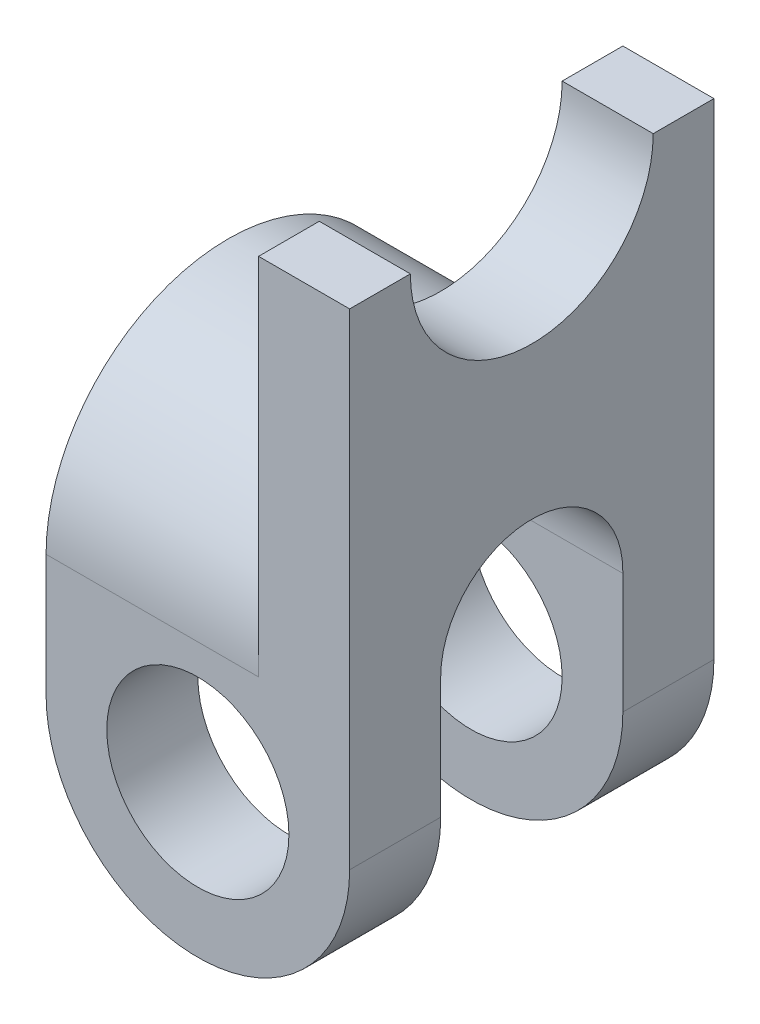
ISO-10303-21;
HEADER;
FILE_DESCRIPTION(('STEP AP214'),'2;1');
FILE_NAME('part.step','',(''),(''),'','','');
FILE_SCHEMA(('AUTOMOTIVE_DESIGN { 1 0 10303 214 1 1 1 1 }'));
ENDSEC;
DATA;
#1=APPLICATION_CONTEXT('core data for automotive mechanical design processes');
#2=APPLICATION_PROTOCOL_DEFINITION('international standard','automotive_design',2000,#1);
#3=PRODUCT_CONTEXT('',#1,'mechanical');
#4=PRODUCT('Part','Part','',(#3));
#5=PRODUCT_RELATED_PRODUCT_CATEGORY('part','',(#4));
#6=PRODUCT_DEFINITION_FORMATION('','',#4);
#7=PRODUCT_DEFINITION_CONTEXT('part definition',#1,'design');
#8=PRODUCT_DEFINITION('design','',#6,#7);
#9=PRODUCT_DEFINITION_SHAPE('','',#8);
#10=(LENGTH_UNIT() NAMED_UNIT(*) SI_UNIT(.MILLI.,.METRE.));
#11=(NAMED_UNIT(*) PLANE_ANGLE_UNIT() SI_UNIT($,.RADIAN.));
#12=(NAMED_UNIT(*) SI_UNIT($,.STERADIAN.) SOLID_ANGLE_UNIT());
#13=UNCERTAINTY_MEASURE_WITH_UNIT(LENGTH_MEASURE(1.E-05),#10,'distance_accuracy_value','');
#14=(GEOMETRIC_REPRESENTATION_CONTEXT(3) GLOBAL_UNCERTAINTY_ASSIGNED_CONTEXT((#13)) GLOBAL_UNIT_ASSIGNED_CONTEXT((#10,
#11,#12)) REPRESENTATION_CONTEXT('',''));
#15=CARTESIAN_POINT('',(0.,0.,0.));
#16=DIRECTION('',(0.,0.,1.));
#17=DIRECTION('',(1.,0.,0.));
#18=AXIS2_PLACEMENT_3D('',#15,#16,#17);
#19=CARTESIAN_POINT('',(0.,0.,30.));
#20=DIRECTION('',(0.,0.,-1.));
#21=DIRECTION('',(-1.,0.,0.));
#22=AXIS2_PLACEMENT_3D('',#19,#20,#21);
#23=CYLINDRICAL_SURFACE('',#22,25.);
#24=DIRECTION('',(0.,0.,-1.));
#25=VECTOR('',#24,1.);
#26=CARTESIAN_POINT('',(25.,0.,30.));
#27=LINE('',#26,#25);
#28=CARTESIAN_POINT('',(25.,0.,-15.));
#29=VERTEX_POINT('',#28);
#30=CARTESIAN_POINT('',(25.,0.,-30.));
#31=VERTEX_POINT('',#30);
#32=EDGE_CURVE('E262',#29,#31,#27,.T.);
#33=ORIENTED_EDGE('',*,*,#32,.F.);
#34=CARTESIAN_POINT('',(0.,0.,-15.));
#35=DIRECTION('',(0.,0.,-1.));
#36=DIRECTION('',(-1.,0.,0.));
#37=AXIS2_PLACEMENT_3D('',#34,#35,#36);
#38=CIRCLE('',#37,25.);
#39=CARTESIAN_POINT('',(-25.,0.,-15.));
#40=VERTEX_POINT('',#39);
#41=EDGE_CURVE('E174',#29,#40,#38,.T.);
#42=ORIENTED_EDGE('',*,*,#41,.T.);
#43=DIRECTION('',(0.,0.,-1.));
#44=VECTOR('',#43,1.);
#45=CARTESIAN_POINT('',(-25.,0.,30.));
#46=LINE('',#45,#44);
#47=CARTESIAN_POINT('',(-25.,0.,-30.));
#48=VERTEX_POINT('',#47);
#49=EDGE_CURVE('E225',#40,#48,#46,.T.);
#50=ORIENTED_EDGE('',*,*,#49,.T.);
#51=CARTESIAN_POINT('',(0.,0.,-30.));
#52=DIRECTION('',(0.,0.,1.));
#53=DIRECTION('',(1.,0.,0.));
#54=AXIS2_PLACEMENT_3D('',#51,#52,#53);
#55=CIRCLE('',#54,25.);
#56=EDGE_CURVE('E199',#48,#31,#55,.T.);
#57=ORIENTED_EDGE('',*,*,#56,.T.);
#58=EDGE_LOOP('',(#33,#42,#50,#57));
#59=FACE_BOUND('',#58,.T.);
#60=ADVANCED_FACE('F43',(#59),#23,.T.);
#61=CARTESIAN_POINT('',(0.,0.,30.));
#62=DIRECTION('',(0.,0.,-1.));
#63=DIRECTION('',(-1.,0.,0.));
#64=AXIS2_PLACEMENT_3D('',#61,#62,#63);
#65=CYLINDRICAL_SURFACE('',#64,15.);
#66=CARTESIAN_POINT('',(0.,0.,-15.));
#67=DIRECTION('',(0.,0.,-1.));
#68=DIRECTION('',(-1.,0.,0.));
#69=AXIS2_PLACEMENT_3D('',#66,#67,#68);
#70=CIRCLE('',#69,15.);
#71=CARTESIAN_POINT('',(-15.,0.,-15.));
#72=VERTEX_POINT('',#71);
#73=EDGE_CURVE('E47',#72,#72,#70,.T.);
#74=ORIENTED_EDGE('',*,*,#73,.F.);
#75=EDGE_LOOP('',(#74));
#76=FACE_BOUND('',#75,.T.);
#77=CARTESIAN_POINT('',(0.,0.,-30.));
#78=DIRECTION('',(0.,0.,1.));
#79=DIRECTION('',(1.,0.,0.));
#80=AXIS2_PLACEMENT_3D('',#77,#78,#79);
#81=CIRCLE('',#80,15.);
#82=CARTESIAN_POINT('',(15.,0.,-30.));
#83=VERTEX_POINT('',#82);
#84=EDGE_CURVE('E194',#83,#83,#81,.T.);
#85=ORIENTED_EDGE('',*,*,#84,.F.);
#86=EDGE_LOOP('',(#85));
#87=FACE_BOUND('',#86,.T.);
#88=ADVANCED_FACE('F275',(#76,#87),#65,.F.);
#89=CARTESIAN_POINT('',(10.,22.9128784747792,30.));
#90=DIRECTION('',(1.,0.,0.));
#91=DIRECTION('',(0.,0.,-1.));
#92=AXIS2_PLACEMENT_3D('',#89,#90,#91);
#93=PLANE('',#92);
#94=DIRECTION('',(0.,-1.,0.));
#95=VECTOR('',#94,1.);
#96=CARTESIAN_POINT('',(10.,22.9128784747792,-30.));
#97=LINE('',#96,#95);
#98=CARTESIAN_POINT('',(10.,80.,-30.));
#99=VERTEX_POINT('',#98);
#100=CARTESIAN_POINT('',(10.,20.,-30.));
#101=VERTEX_POINT('',#100);
#102=EDGE_CURVE('E237',#99,#101,#97,.T.);
#103=ORIENTED_EDGE('',*,*,#102,.T.);
#104=CARTESIAN_POINT('',(10.,20.,0.));
#105=DIRECTION('',(1.,0.,0.));
#106=DIRECTION('',(0.,0.,-1.));
#107=AXIS2_PLACEMENT_3D('',#104,#105,#106);
#108=CIRCLE('',#107,30.);
#109=CARTESIAN_POINT('',(10.,20.,30.));
#110=VERTEX_POINT('',#109);
#111=EDGE_CURVE('E181',#110,#101,#108,.F.);
#112=ORIENTED_EDGE('',*,*,#111,.F.);
#113=DIRECTION('',(0.,-1.,0.));
#114=VECTOR('',#113,1.);
#115=CARTESIAN_POINT('',(10.,80.,30.));
#116=LINE('',#115,#114);
#117=CARTESIAN_POINT('',(10.,80.,30.));
#118=VERTEX_POINT('',#117);
#119=EDGE_CURVE('E214',#118,#110,#116,.T.);
#120=ORIENTED_EDGE('',*,*,#119,.F.);
#121=DIRECTION('',(0.,0.,-1.));
#122=VECTOR('',#121,1.);
#123=CARTESIAN_POINT('',(10.,80.,30.));
#124=LINE('',#123,#122);
#125=CARTESIAN_POINT('',(10.,80.,20.));
#126=VERTEX_POINT('',#125);
#127=EDGE_CURVE('E253',#118,#126,#124,.T.);
#128=ORIENTED_EDGE('',*,*,#127,.T.);
#129=CARTESIAN_POINT('',(10.,80.,0.));
#130=DIRECTION('',(1.,0.,0.));
#131=DIRECTION('',(0.,0.,-1.));
#132=AXIS2_PLACEMENT_3D('',#129,#130,#131);
#133=CIRCLE('',#132,20.);
#134=CARTESIAN_POINT('',(10.,80.,-20.));
#135=VERTEX_POINT('',#134);
#136=EDGE_CURVE('E11',#126,#135,#133,.T.);
#137=ORIENTED_EDGE('',*,*,#136,.T.);
#138=EDGE_CURVE('E252',#135,#99,#124,.T.);
#139=ORIENTED_EDGE('',*,*,#138,.T.);
#140=EDGE_LOOP('',(#103,#112,#120,#128,#137,#139));
#141=FACE_BOUND('',#140,.T.);
#142=ADVANCED_FACE('F290',(#141),#93,.F.);
#143=CARTESIAN_POINT('',(25.,80.,30.));
#144=DIRECTION('',(0.,-1.,0.));
#145=DIRECTION('',(0.,0.,-1.));
#146=AXIS2_PLACEMENT_3D('',#143,#144,#145);
#147=PLANE('',#146);
#148=DIRECTION('',(0.,0.,-1.));
#149=VECTOR('',#148,1.);
#150=CARTESIAN_POINT('',(25.,80.,30.));
#151=LINE('',#150,#149);
#152=CARTESIAN_POINT('',(25.,80.,30.));
#153=VERTEX_POINT('',#152);
#154=CARTESIAN_POINT('',(25.,80.,20.));
#155=VERTEX_POINT('',#154);
#156=EDGE_CURVE('E258',#153,#155,#151,.T.);
#157=ORIENTED_EDGE('',*,*,#156,.T.);
#158=DIRECTION('',(-1.,0.,0.));
#159=VECTOR('',#158,1.);
#160=CARTESIAN_POINT('',(25.,80.,20.));
#161=LINE('',#160,#159);
#162=EDGE_CURVE('E190',#155,#126,#161,.T.);
#163=ORIENTED_EDGE('',*,*,#162,.T.);
#164=ORIENTED_EDGE('',*,*,#127,.F.);
#165=DIRECTION('',(-1.,0.,0.));
#166=VECTOR('',#165,1.);
#167=CARTESIAN_POINT('',(25.,80.,30.));
#168=LINE('',#167,#166);
#169=EDGE_CURVE('E211',#153,#118,#168,.T.);
#170=ORIENTED_EDGE('',*,*,#169,.F.);
#171=EDGE_LOOP('',(#157,#163,#164,#170));
#172=FACE_BOUND('',#171,.T.);
#173=ADVANCED_FACE('F281',(#172),#147,.F.);
#174=CARTESIAN_POINT('',(0.,0.,30.));
#175=DIRECTION('',(0.,0.,1.));
#176=DIRECTION('',(1.,0.,0.));
#177=AXIS2_PLACEMENT_3D('',#174,#175,#176);
#178=PLANE('',#177);
#179=CARTESIAN_POINT('',(0.,0.,30.));
#180=DIRECTION('',(0.,0.,1.));
#181=DIRECTION('',(1.,0.,0.));
#182=AXIS2_PLACEMENT_3D('',#179,#180,#181);
#183=CIRCLE('',#182,25.);
#184=CARTESIAN_POINT('',(-25.,0.,30.));
#185=VERTEX_POINT('',#184);
#186=CARTESIAN_POINT('',(25.,0.,30.));
#187=VERTEX_POINT('',#186);
#188=EDGE_CURVE('E203',#185,#187,#183,.T.);
#189=ORIENTED_EDGE('',*,*,#188,.T.);
#190=DIRECTION('',(0.,1.,0.));
#191=VECTOR('',#190,1.);
#192=CARTESIAN_POINT('',(25.,0.,30.));
#193=LINE('',#192,#191);
#194=EDGE_CURVE('E207',#187,#153,#193,.T.);
#195=ORIENTED_EDGE('',*,*,#194,.T.);
#196=ORIENTED_EDGE('',*,*,#169,.T.);
#197=ORIENTED_EDGE('',*,*,#119,.T.);
#198=DIRECTION('',(-1.,0.,0.));
#199=VECTOR('',#198,1.);
#200=CARTESIAN_POINT('',(-25.,20.,30.));
#201=LINE('',#200,#199);
#202=CARTESIAN_POINT('',(-25.,20.,30.));
#203=VERTEX_POINT('',#202);
#204=EDGE_CURVE('E218',#110,#203,#201,.T.);
#205=ORIENTED_EDGE('',*,*,#204,.T.);
#206=DIRECTION('',(0.,-1.,0.));
#207=VECTOR('',#206,1.);
#208=CARTESIAN_POINT('',(-25.,0.,30.));
#209=LINE('',#208,#207);
#210=EDGE_CURVE('E222',#203,#185,#209,.T.);
#211=ORIENTED_EDGE('',*,*,#210,.T.);
#212=EDGE_LOOP('',(#189,#195,#196,#197,#205,#211));
#213=FACE_BOUND('',#212,.T.);
#214=CARTESIAN_POINT('',(0.,0.,30.));
#215=DIRECTION('',(0.,0.,1.));
#216=DIRECTION('',(1.,0.,0.));
#217=AXIS2_PLACEMENT_3D('',#214,#215,#216);
#218=CIRCLE('',#217,15.);
#219=CARTESIAN_POINT('',(15.,0.,30.));
#220=VERTEX_POINT('',#219);
#221=EDGE_CURVE('E195',#220,#220,#218,.T.);
#222=ORIENTED_EDGE('',*,*,#221,.F.);
#223=EDGE_LOOP('',(#222));
#224=FACE_BOUND('',#223,.T.);
#225=ADVANCED_FACE('F278',(#213,#224),#178,.T.);
#226=CARTESIAN_POINT('',(0.,0.,-30.));
#227=DIRECTION('',(0.,0.,1.));
#228=DIRECTION('',(1.,0.,0.));
#229=AXIS2_PLACEMENT_3D('',#226,#227,#228);
#230=PLANE('',#229);
#231=ORIENTED_EDGE('',*,*,#56,.F.);
#232=DIRECTION('',(0.,-1.,0.));
#233=VECTOR('',#232,1.);
#234=CARTESIAN_POINT('',(-25.,0.,-30.));
#235=LINE('',#234,#233);
#236=CARTESIAN_POINT('',(-25.,20.,-30.));
#237=VERTEX_POINT('',#236);
#238=EDGE_CURVE('E208',#237,#48,#235,.T.);
#239=ORIENTED_EDGE('',*,*,#238,.F.);
#240=DIRECTION('',(-1.,0.,0.));
#241=VECTOR('',#240,1.);
#242=CARTESIAN_POINT('',(-25.,20.,-30.));
#243=LINE('',#242,#241);
#244=EDGE_CURVE('E241',#101,#237,#243,.T.);
#245=ORIENTED_EDGE('',*,*,#244,.F.);
#246=ORIENTED_EDGE('',*,*,#102,.F.);
#247=DIRECTION('',(-1.,0.,0.));
#248=VECTOR('',#247,1.);
#249=CARTESIAN_POINT('',(25.,80.,-30.));
#250=LINE('',#249,#248);
#251=CARTESIAN_POINT('',(25.,80.,-30.));
#252=VERTEX_POINT('',#251);
#253=EDGE_CURVE('E233',#252,#99,#250,.T.);
#254=ORIENTED_EDGE('',*,*,#253,.F.);
#255=DIRECTION('',(0.,1.,0.));
#256=VECTOR('',#255,1.);
#257=CARTESIAN_POINT('',(25.,0.,-30.));
#258=LINE('',#257,#256);
#259=EDGE_CURVE('E229',#31,#252,#258,.T.);
#260=ORIENTED_EDGE('',*,*,#259,.F.);
#261=EDGE_LOOP('',(#231,#239,#245,#246,#254,#260));
#262=FACE_BOUND('',#261,.T.);
#263=ORIENTED_EDGE('',*,*,#84,.T.);
#264=EDGE_LOOP('',(#263));
#265=FACE_BOUND('',#264,.T.);
#266=ADVANCED_FACE('F280',(#262,#265),#230,.F.);
#267=CARTESIAN_POINT('',(-25.,0.,15.0016961305231));
#268=VERTEX_POINT('',#267);
#269=EDGE_CURVE('E248',#185,#268,#46,.T.);
#270=ORIENTED_EDGE('',*,*,#269,.T.);
#271=CARTESIAN_POINT('',(0.,0.,15.0016961305231));
#272=DIRECTION('',(0.,0.,1.));
#273=DIRECTION('',(1.,0.,0.));
#274=AXIS2_PLACEMENT_3D('',#271,#272,#273);
#275=CIRCLE('',#274,25.);
#276=CARTESIAN_POINT('',(25.,0.,15.0016961305231));
#277=VERTEX_POINT('',#276);
#278=EDGE_CURVE('E61',#268,#277,#275,.T.);
#279=ORIENTED_EDGE('',*,*,#278,.T.);
#280=EDGE_CURVE('E53',#187,#277,#27,.T.);
#281=ORIENTED_EDGE('',*,*,#280,.F.);
#282=ORIENTED_EDGE('',*,*,#188,.F.);
#283=EDGE_LOOP('',(#270,#279,#281,#282));
#284=FACE_BOUND('',#283,.T.);
#285=ADVANCED_FACE('F45',(#284),#23,.T.);
#286=CARTESIAN_POINT('',(25.,0.,30.));
#287=DIRECTION('',(-1.,0.,0.));
#288=DIRECTION('',(0.,0.,1.));
#289=AXIS2_PLACEMENT_3D('',#286,#287,#288);
#290=PLANE('',#289);
#291=CARTESIAN_POINT('',(25.,20.,0.));
#292=DIRECTION('',(-1.,0.,0.));
#293=DIRECTION('',(0.,0.,1.));
#294=AXIS2_PLACEMENT_3D('',#291,#292,#293);
#295=CIRCLE('',#294,15.0016961305231);
#296=CARTESIAN_POINT('',(25.,20.,15.0016961305231));
#297=VERTEX_POINT('',#296);
#298=CARTESIAN_POINT('',(25.,19.7744189889359,-15.));
#299=VERTEX_POINT('',#298);
#300=EDGE_CURVE('E146',#297,#299,#295,.T.);
#301=ORIENTED_EDGE('',*,*,#300,.T.);
#302=DIRECTION('',(0.,-1.,0.));
#303=VECTOR('',#302,1.);
#304=CARTESIAN_POINT('',(25.,19.7744189889359,-15.));
#305=LINE('',#304,#303);
#306=EDGE_CURVE('E143',#299,#29,#305,.T.);
#307=ORIENTED_EDGE('',*,*,#306,.T.);
#308=ORIENTED_EDGE('',*,*,#32,.T.);
#309=ORIENTED_EDGE('',*,*,#259,.T.);
#310=CARTESIAN_POINT('',(25.,80.,-20.));
#311=VERTEX_POINT('',#310);
#312=EDGE_CURVE('E257',#311,#252,#151,.T.);
#313=ORIENTED_EDGE('',*,*,#312,.F.);
#314=CARTESIAN_POINT('',(25.,80.,0.));
#315=DIRECTION('',(-1.,0.,0.));
#316=DIRECTION('',(0.,0.,1.));
#317=AXIS2_PLACEMENT_3D('',#314,#315,#316);
#318=CIRCLE('',#317,20.);
#319=EDGE_CURVE('E184',#311,#155,#318,.T.);
#320=ORIENTED_EDGE('',*,*,#319,.T.);
#321=ORIENTED_EDGE('',*,*,#156,.F.);
#322=ORIENTED_EDGE('',*,*,#194,.F.);
#323=ORIENTED_EDGE('',*,*,#280,.T.);
#324=DIRECTION('',(0.,1.,0.));
#325=VECTOR('',#324,1.);
#326=CARTESIAN_POINT('',(25.,-47.367007727097,15.0016961305231));
#327=LINE('',#326,#325);
#328=EDGE_CURVE('E136',#277,#297,#327,.T.);
#329=ORIENTED_EDGE('',*,*,#328,.T.);
#330=EDGE_LOOP('',(#301,#307,#308,#309,#313,#320,#321,#322,#323,#329));
#331=FACE_BOUND('',#330,.T.);
#332=ADVANCED_FACE('F154',(#331),#290,.F.);
#333=ORIENTED_EDGE('',*,*,#138,.F.);
#334=DIRECTION('',(-1.,0.,0.));
#335=VECTOR('',#334,1.);
#336=CARTESIAN_POINT('',(25.,80.,-20.));
#337=LINE('',#336,#335);
#338=EDGE_CURVE('E69',#135,#311,#337,.F.);
#339=ORIENTED_EDGE('',*,*,#338,.T.);
#340=ORIENTED_EDGE('',*,*,#312,.T.);
#341=ORIENTED_EDGE('',*,*,#253,.T.);
#342=EDGE_LOOP('',(#333,#339,#340,#341));
#343=FACE_BOUND('',#342,.T.);
#344=ADVANCED_FACE('F293',(#343),#147,.F.);
#345=CARTESIAN_POINT('',(-25.,0.,30.));
#346=DIRECTION('',(1.,0.,0.));
#347=DIRECTION('',(0.,0.,-1.));
#348=AXIS2_PLACEMENT_3D('',#345,#346,#347);
#349=PLANE('',#348);
#350=ORIENTED_EDGE('',*,*,#49,.F.);
#351=DIRECTION('',(0.,-1.,0.));
#352=VECTOR('',#351,1.);
#353=CARTESIAN_POINT('',(-25.,19.7744189889359,-15.));
#354=LINE('',#353,#352);
#355=CARTESIAN_POINT('',(-25.,19.7744189889359,-15.));
#356=VERTEX_POINT('',#355);
#357=EDGE_CURVE('E157',#356,#40,#354,.T.);
#358=ORIENTED_EDGE('',*,*,#357,.F.);
#359=CARTESIAN_POINT('',(-25.,20.,0.));
#360=DIRECTION('',(-1.,0.,0.));
#361=DIRECTION('',(0.,0.,1.));
#362=AXIS2_PLACEMENT_3D('',#359,#360,#361);
#363=CIRCLE('',#362,15.0016961305231);
#364=CARTESIAN_POINT('',(-25.,20.,15.0016961305231));
#365=VERTEX_POINT('',#364);
#366=EDGE_CURVE('E160',#365,#356,#363,.T.);
#367=ORIENTED_EDGE('',*,*,#366,.F.);
#368=DIRECTION('',(0.,1.,0.));
#369=VECTOR('',#368,1.);
#370=CARTESIAN_POINT('',(-25.,20.,15.0016961305231));
#371=LINE('',#370,#369);
#372=EDGE_CURVE('E137',#268,#365,#371,.T.);
#373=ORIENTED_EDGE('',*,*,#372,.F.);
#374=ORIENTED_EDGE('',*,*,#269,.F.);
#375=ORIENTED_EDGE('',*,*,#210,.F.);
#376=CARTESIAN_POINT('',(-25.,20.,0.));
#377=DIRECTION('',(-1.,0.,0.));
#378=DIRECTION('',(0.,0.,1.));
#379=AXIS2_PLACEMENT_3D('',#376,#377,#378);
#380=CIRCLE('',#379,30.);
#381=EDGE_CURVE('E178',#203,#237,#380,.T.);
#382=ORIENTED_EDGE('',*,*,#381,.T.);
#383=ORIENTED_EDGE('',*,*,#238,.T.);
#384=EDGE_LOOP('',(#350,#358,#367,#373,#374,#375,#382,#383));
#385=FACE_BOUND('',#384,.T.);
#386=ADVANCED_FACE('F273',(#385),#349,.F.);
#387=CARTESIAN_POINT('',(0.,0.,15.0016961305231));
#388=DIRECTION('',(0.,0.,1.));
#389=DIRECTION('',(1.,0.,0.));
#390=AXIS2_PLACEMENT_3D('',#387,#388,#389);
#391=CIRCLE('',#390,15.);
#392=CARTESIAN_POINT('',(15.,0.,15.0016961305231));
#393=VERTEX_POINT('',#392);
#394=EDGE_CURVE('E170',#393,#393,#391,.T.);
#395=ORIENTED_EDGE('',*,*,#394,.F.);
#396=EDGE_LOOP('',(#395));
#397=FACE_BOUND('',#396,.T.);
#398=ORIENTED_EDGE('',*,*,#221,.T.);
#399=EDGE_LOOP('',(#398));
#400=FACE_BOUND('',#399,.T.);
#401=ADVANCED_FACE('F269',(#397,#400),#65,.F.);
#402=CARTESIAN_POINT('',(25.,80.,0.));
#403=DIRECTION('',(-1.,0.,0.));
#404=DIRECTION('',(0.,0.,1.));
#405=AXIS2_PLACEMENT_3D('',#402,#403,#404);
#406=CYLINDRICAL_SURFACE('',#405,20.);
#407=ORIENTED_EDGE('',*,*,#319,.F.);
#408=ORIENTED_EDGE('',*,*,#338,.F.);
#409=ORIENTED_EDGE('',*,*,#136,.F.);
#410=ORIENTED_EDGE('',*,*,#162,.F.);
#411=EDGE_LOOP('',(#407,#408,#409,#410));
#412=FACE_BOUND('',#411,.T.);
#413=ADVANCED_FACE('F272',(#412),#406,.F.);
#414=CARTESIAN_POINT('',(77.0820393249937,20.,0.));
#415=DIRECTION('',(-1.,0.,0.));
#416=DIRECTION('',(0.,0.,1.));
#417=AXIS2_PLACEMENT_3D('',#414,#415,#416);
#418=CYLINDRICAL_SURFACE('',#417,30.);
#419=ORIENTED_EDGE('',*,*,#204,.F.);
#420=ORIENTED_EDGE('',*,*,#111,.T.);
#421=ORIENTED_EDGE('',*,*,#244,.T.);
#422=ORIENTED_EDGE('',*,*,#381,.F.);
#423=EDGE_LOOP('',(#419,#420,#421,#422));
#424=FACE_BOUND('',#423,.T.);
#425=ADVANCED_FACE('F328',(#424),#418,.T.);
#426=CARTESIAN_POINT('',(25.,19.7744189889359,-15.));
#427=DIRECTION('',(0.,0.,-1.));
#428=DIRECTION('',(-1.,0.,0.));
#429=AXIS2_PLACEMENT_3D('',#426,#427,#428);
#430=PLANE('',#429);
#431=ORIENTED_EDGE('',*,*,#73,.T.);
#432=EDGE_LOOP('',(#431));
#433=FACE_BOUND('',#432,.T.);
#434=ORIENTED_EDGE('',*,*,#306,.F.);
#435=DIRECTION('',(-1.,0.,0.));
#436=VECTOR('',#435,1.);
#437=CARTESIAN_POINT('',(25.,19.7744189889359,-15.));
#438=LINE('',#437,#436);
#439=EDGE_CURVE('E142',#299,#356,#438,.T.);
#440=ORIENTED_EDGE('',*,*,#439,.T.);
#441=ORIENTED_EDGE('',*,*,#357,.T.);
#442=ORIENTED_EDGE('',*,*,#41,.F.);
#443=EDGE_LOOP('',(#434,#440,#441,#442));
#444=FACE_BOUND('',#443,.T.);
#445=ADVANCED_FACE('F313',(#433,#444),#430,.F.);
#446=CARTESIAN_POINT('',(25.,20.,15.0016961305231));
#447=DIRECTION('',(0.,0.,1.));
#448=DIRECTION('',(1.,0.,0.));
#449=AXIS2_PLACEMENT_3D('',#446,#447,#448);
#450=PLANE('',#449);
#451=ORIENTED_EDGE('',*,*,#394,.T.);
#452=EDGE_LOOP('',(#451));
#453=FACE_BOUND('',#452,.T.);
#454=ORIENTED_EDGE('',*,*,#372,.T.);
#455=DIRECTION('',(-1.,0.,0.));
#456=VECTOR('',#455,1.);
#457=CARTESIAN_POINT('',(25.,20.,15.0016961305231));
#458=LINE('',#457,#456);
#459=EDGE_CURVE('E132',#297,#365,#458,.T.);
#460=ORIENTED_EDGE('',*,*,#459,.F.);
#461=ORIENTED_EDGE('',*,*,#328,.F.);
#462=ORIENTED_EDGE('',*,*,#278,.F.);
#463=EDGE_LOOP('',(#454,#460,#461,#462));
#464=FACE_BOUND('',#463,.T.);
#465=ADVANCED_FACE('F134',(#453,#464),#450,.F.);
#466=CARTESIAN_POINT('',(25.,20.,0.));
#467=DIRECTION('',(-1.,0.,0.));
#468=DIRECTION('',(0.,0.,1.));
#469=AXIS2_PLACEMENT_3D('',#466,#467,#468);
#470=CYLINDRICAL_SURFACE('',#469,15.0016961305231);
#471=ORIENTED_EDGE('',*,*,#366,.T.);
#472=ORIENTED_EDGE('',*,*,#439,.F.);
#473=ORIENTED_EDGE('',*,*,#300,.F.);
#474=ORIENTED_EDGE('',*,*,#459,.T.);
#475=EDGE_LOOP('',(#471,#472,#473,#474));
#476=FACE_BOUND('',#475,.T.);
#477=ADVANCED_FACE('F147',(#476),#470,.F.);
#478=CLOSED_SHELL('',(#60,#88,#142,#173,#225,#266,#285,#332,#344,#386,#401,#413,#425,#445,#465,#477));
#479=MANIFOLD_SOLID_BREP('B2',#478);
#480=ADVANCED_BREP_SHAPE_REPRESENTATION('',(#18,#479),#14);
#481=SHAPE_DEFINITION_REPRESENTATION(#9,#480);
ENDSEC;
END-ISO-10303-21;
